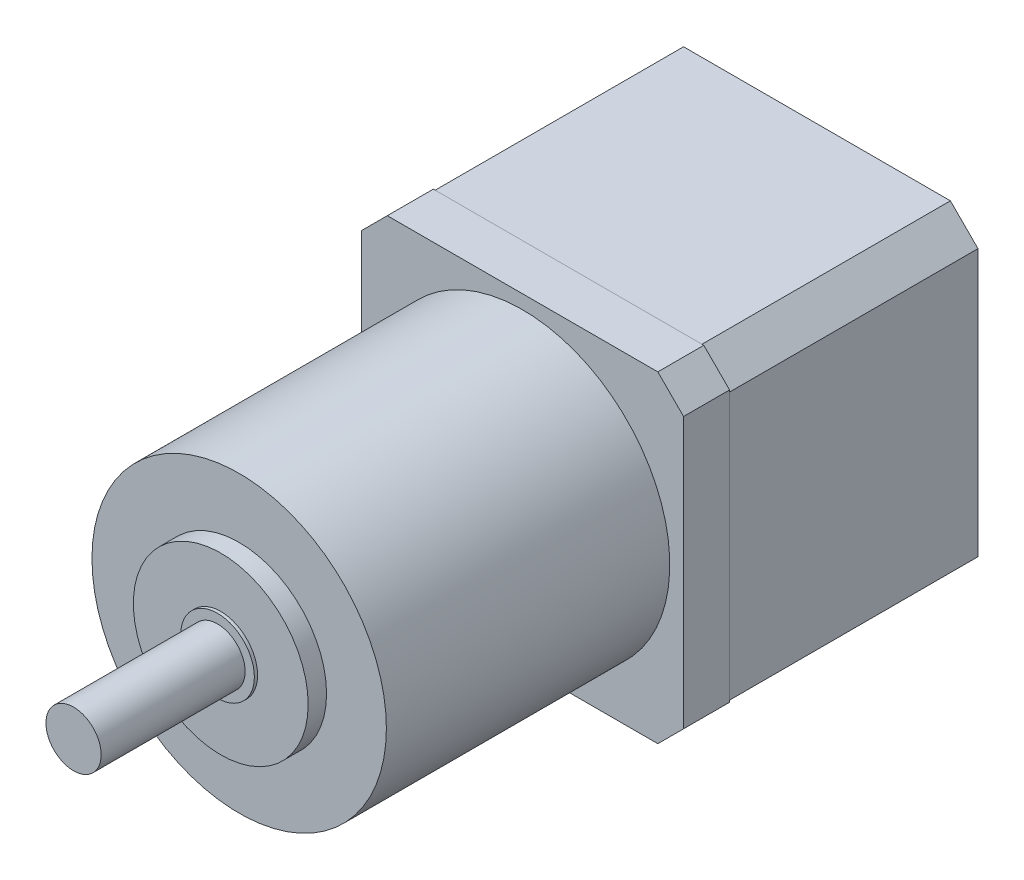
ISO-10303-21;
HEADER;
FILE_DESCRIPTION(('STEP AP214'),'2;1');
FILE_NAME('part.step','',(''),(''),'','','');
FILE_SCHEMA(('AUTOMOTIVE_DESIGN { 1 0 10303 214 1 1 1 1 }'));
ENDSEC;
DATA;
#1=APPLICATION_CONTEXT('core data for automotive mechanical design processes');
#2=APPLICATION_PROTOCOL_DEFINITION('international standard','automotive_design',2000,#1);
#3=PRODUCT_CONTEXT('',#1,'mechanical');
#4=PRODUCT('Part','Part','',(#3));
#5=PRODUCT_RELATED_PRODUCT_CATEGORY('part','',(#4));
#6=PRODUCT_DEFINITION_FORMATION('','',#4);
#7=PRODUCT_DEFINITION_CONTEXT('part definition',#1,'design');
#8=PRODUCT_DEFINITION('design','',#6,#7);
#9=PRODUCT_DEFINITION_SHAPE('','',#8);
#10=(LENGTH_UNIT() NAMED_UNIT(*) SI_UNIT(.MILLI.,.METRE.));
#11=(NAMED_UNIT(*) PLANE_ANGLE_UNIT() SI_UNIT($,.RADIAN.));
#12=(NAMED_UNIT(*) SI_UNIT($,.STERADIAN.) SOLID_ANGLE_UNIT());
#13=UNCERTAINTY_MEASURE_WITH_UNIT(LENGTH_MEASURE(1.E-05),#10,'distance_accuracy_value','');
#14=(GEOMETRIC_REPRESENTATION_CONTEXT(3) GLOBAL_UNCERTAINTY_ASSIGNED_CONTEXT((#13)) GLOBAL_UNIT_ASSIGNED_CONTEXT((#10,
#11,#12)) REPRESENTATION_CONTEXT('',''));
#15=CARTESIAN_POINT('',(0.,0.,0.));
#16=DIRECTION('',(0.,0.,1.));
#17=DIRECTION('',(1.,0.,0.));
#18=AXIS2_PLACEMENT_3D('',#15,#16,#17);
#19=CARTESIAN_POINT('',(17.5,-17.5,32.));
#20=DIRECTION('',(-1.,0.,0.));
#21=DIRECTION('',(0.,0.,1.));
#22=AXIS2_PLACEMENT_3D('',#19,#20,#21);
#23=PLANE('',#22);
#24=DIRECTION('',(0.,1.,0.));
#25=VECTOR('',#24,1.);
#26=CARTESIAN_POINT('',(17.5,-17.5,32.));
#27=LINE('',#26,#25);
#28=CARTESIAN_POINT('',(17.5,-14.7,32.));
#29=VERTEX_POINT('',#28);
#30=CARTESIAN_POINT('',(17.5,14.7,32.));
#31=VERTEX_POINT('',#30);
#32=EDGE_CURVE('E139',#29,#31,#27,.T.);
#33=ORIENTED_EDGE('',*,*,#32,.F.);
#34=DIRECTION('',(0.,0.,-1.));
#35=VECTOR('',#34,1.);
#36=CARTESIAN_POINT('',(17.5,-14.7,32.));
#37=LINE('',#36,#35);
#38=CARTESIAN_POINT('',(17.5,-14.7,27.));
#39=VERTEX_POINT('',#38);
#40=EDGE_CURVE('E165',#29,#39,#37,.T.);
#41=ORIENTED_EDGE('',*,*,#40,.T.);
#42=DIRECTION('',(0.,1.,0.));
#43=VECTOR('',#42,1.);
#44=CARTESIAN_POINT('',(17.5,-17.5,27.));
#45=LINE('',#44,#43);
#46=CARTESIAN_POINT('',(17.5,14.7,27.));
#47=VERTEX_POINT('',#46);
#48=EDGE_CURVE('E176',#39,#47,#45,.T.);
#49=ORIENTED_EDGE('',*,*,#48,.T.);
#50=DIRECTION('',(0.,0.,1.));
#51=VECTOR('',#50,1.);
#52=CARTESIAN_POINT('',(17.5,14.7,32.));
#53=LINE('',#52,#51);
#54=EDGE_CURVE('E163',#47,#31,#53,.T.);
#55=ORIENTED_EDGE('',*,*,#54,.T.);
#56=EDGE_LOOP('',(#33,#41,#49,#55));
#57=FACE_BOUND('',#56,.T.);
#58=ADVANCED_FACE('F46',(#57),#23,.F.);
#59=CARTESIAN_POINT('',(-17.5,17.5,32.));
#60=DIRECTION('',(0.,-1.,0.));
#61=DIRECTION('',(0.,0.,-1.));
#62=AXIS2_PLACEMENT_3D('',#59,#60,#61);
#63=PLANE('',#62);
#64=DIRECTION('',(-1.,0.,0.));
#65=VECTOR('',#64,1.);
#66=CARTESIAN_POINT('',(-17.5,17.5,27.));
#67=LINE('',#66,#65);
#68=CARTESIAN_POINT('',(14.7,17.5,27.));
#69=VERTEX_POINT('',#68);
#70=CARTESIAN_POINT('',(-14.7,17.5,27.));
#71=VERTEX_POINT('',#70);
#72=EDGE_CURVE('E144',#69,#71,#67,.T.);
#73=ORIENTED_EDGE('',*,*,#72,.T.);
#74=DIRECTION('',(0.,0.,1.));
#75=VECTOR('',#74,1.);
#76=CARTESIAN_POINT('',(-14.7,17.5,32.));
#77=LINE('',#76,#75);
#78=CARTESIAN_POINT('',(-14.7,17.5,32.));
#79=VERTEX_POINT('',#78);
#80=EDGE_CURVE('E55',#71,#79,#77,.T.);
#81=ORIENTED_EDGE('',*,*,#80,.T.);
#82=DIRECTION('',(-1.,0.,0.));
#83=VECTOR('',#82,1.);
#84=CARTESIAN_POINT('',(-17.5,17.5,32.));
#85=LINE('',#84,#83);
#86=CARTESIAN_POINT('',(14.7,17.5,32.));
#87=VERTEX_POINT('',#86);
#88=EDGE_CURVE('E142',#87,#79,#85,.T.);
#89=ORIENTED_EDGE('',*,*,#88,.F.);
#90=DIRECTION('',(0.,0.,-1.));
#91=VECTOR('',#90,1.);
#92=CARTESIAN_POINT('',(14.7,17.5,32.));
#93=LINE('',#92,#91);
#94=EDGE_CURVE('E168',#87,#69,#93,.T.);
#95=ORIENTED_EDGE('',*,*,#94,.T.);
#96=EDGE_LOOP('',(#73,#81,#89,#95));
#97=FACE_BOUND('',#96,.T.);
#98=ADVANCED_FACE('F173',(#97),#63,.F.);
#99=CARTESIAN_POINT('',(-17.5,-17.5,32.));
#100=DIRECTION('',(1.,0.,0.));
#101=DIRECTION('',(0.,0.,-1.));
#102=AXIS2_PLACEMENT_3D('',#99,#100,#101);
#103=PLANE('',#102);
#104=DIRECTION('',(0.,-1.,0.));
#105=VECTOR('',#104,1.);
#106=CARTESIAN_POINT('',(-17.5,-17.5,27.));
#107=LINE('',#106,#105);
#108=CARTESIAN_POINT('',(-17.5,14.7,27.));
#109=VERTEX_POINT('',#108);
#110=CARTESIAN_POINT('',(-17.5,-14.7,27.));
#111=VERTEX_POINT('',#110);
#112=EDGE_CURVE('E140',#109,#111,#107,.T.);
#113=ORIENTED_EDGE('',*,*,#112,.T.);
#114=DIRECTION('',(0.,0.,1.));
#115=VECTOR('',#114,1.);
#116=CARTESIAN_POINT('',(-17.5,-14.7,32.));
#117=LINE('',#116,#115);
#118=CARTESIAN_POINT('',(-17.5,-14.7,32.));
#119=VERTEX_POINT('',#118);
#120=EDGE_CURVE('E118',#111,#119,#117,.T.);
#121=ORIENTED_EDGE('',*,*,#120,.T.);
#122=DIRECTION('',(0.,-1.,0.));
#123=VECTOR('',#122,1.);
#124=CARTESIAN_POINT('',(-17.5,-17.5,32.));
#125=LINE('',#124,#123);
#126=CARTESIAN_POINT('',(-17.5,14.7,32.));
#127=VERTEX_POINT('',#126);
#128=EDGE_CURVE('E181',#127,#119,#125,.T.);
#129=ORIENTED_EDGE('',*,*,#128,.F.);
#130=DIRECTION('',(0.,0.,-1.));
#131=VECTOR('',#130,1.);
#132=CARTESIAN_POINT('',(-17.5,14.7,32.));
#133=LINE('',#132,#131);
#134=EDGE_CURVE('E123',#127,#109,#133,.T.);
#135=ORIENTED_EDGE('',*,*,#134,.T.);
#136=EDGE_LOOP('',(#113,#121,#129,#135));
#137=FACE_BOUND('',#136,.T.);
#138=ADVANCED_FACE('F229',(#137),#103,.F.);
#139=CARTESIAN_POINT('',(-17.5,-17.5,32.));
#140=DIRECTION('',(0.,1.,0.));
#141=DIRECTION('',(0.,0.,1.));
#142=AXIS2_PLACEMENT_3D('',#139,#140,#141);
#143=PLANE('',#142);
#144=DIRECTION('',(1.,0.,0.));
#145=VECTOR('',#144,1.);
#146=CARTESIAN_POINT('',(-17.5,-17.5,32.));
#147=LINE('',#146,#145);
#148=CARTESIAN_POINT('',(-14.7,-17.5,32.));
#149=VERTEX_POINT('',#148);
#150=CARTESIAN_POINT('',(14.7,-17.5,32.));
#151=VERTEX_POINT('',#150);
#152=EDGE_CURVE('E133',#149,#151,#147,.T.);
#153=ORIENTED_EDGE('',*,*,#152,.F.);
#154=DIRECTION('',(0.,0.,-1.));
#155=VECTOR('',#154,1.);
#156=CARTESIAN_POINT('',(-14.7,-17.5,32.));
#157=LINE('',#156,#155);
#158=CARTESIAN_POINT('',(-14.7,-17.5,27.));
#159=VERTEX_POINT('',#158);
#160=EDGE_CURVE('E117',#149,#159,#157,.T.);
#161=ORIENTED_EDGE('',*,*,#160,.T.);
#162=DIRECTION('',(1.,0.,0.));
#163=VECTOR('',#162,1.);
#164=CARTESIAN_POINT('',(-17.5,-17.5,27.));
#165=LINE('',#164,#163);
#166=CARTESIAN_POINT('',(14.7,-17.5,27.));
#167=VERTEX_POINT('',#166);
#168=EDGE_CURVE('E130',#159,#167,#165,.T.);
#169=ORIENTED_EDGE('',*,*,#168,.T.);
#170=DIRECTION('',(0.,0.,1.));
#171=VECTOR('',#170,1.);
#172=CARTESIAN_POINT('',(14.7,-17.5,32.));
#173=LINE('',#172,#171);
#174=EDGE_CURVE('E135',#167,#151,#173,.T.);
#175=ORIENTED_EDGE('',*,*,#174,.T.);
#176=EDGE_LOOP('',(#153,#161,#169,#175));
#177=FACE_BOUND('',#176,.T.);
#178=ADVANCED_FACE('F129',(#177),#143,.F.);
#179=CARTESIAN_POINT('',(0.,0.,32.));
#180=DIRECTION('',(0.,0.,-1.));
#181=DIRECTION('',(-1.,0.,0.));
#182=AXIS2_PLACEMENT_3D('',#179,#180,#181);
#183=PLANE('',#182);
#184=CARTESIAN_POINT('',(0.,0.,32.));
#185=DIRECTION('',(0.,0.,-1.));
#186=DIRECTION('',(-1.,0.,0.));
#187=AXIS2_PLACEMENT_3D('',#184,#185,#186);
#188=CIRCLE('',#187,16.);
#189=CARTESIAN_POINT('',(-16.,0.,32.));
#190=VERTEX_POINT('',#189);
#191=EDGE_CURVE('E12',#190,#190,#188,.F.);
#192=ORIENTED_EDGE('',*,*,#191,.F.);
#193=EDGE_LOOP('',(#192));
#194=FACE_BOUND('',#193,.T.);
#195=ORIENTED_EDGE('',*,*,#128,.T.);
#196=DIRECTION('',(-0.707106781186547,0.707106781186548,0.));
#197=VECTOR('',#196,1.);
#198=CARTESIAN_POINT('',(-14.7,-17.5,32.));
#199=LINE('',#198,#197);
#200=EDGE_CURVE('E161',#119,#149,#199,.F.);
#201=ORIENTED_EDGE('',*,*,#200,.T.);
#202=ORIENTED_EDGE('',*,*,#152,.T.);
#203=DIRECTION('',(-0.707106781186548,-0.707106781186547,0.));
#204=VECTOR('',#203,1.);
#205=CARTESIAN_POINT('',(17.5,-14.7,32.));
#206=LINE('',#205,#204);
#207=EDGE_CURVE('E159',#151,#29,#206,.F.);
#208=ORIENTED_EDGE('',*,*,#207,.T.);
#209=ORIENTED_EDGE('',*,*,#32,.T.);
#210=DIRECTION('',(0.707106781186547,-0.707106781186548,0.));
#211=VECTOR('',#210,1.);
#212=CARTESIAN_POINT('',(14.7,17.5,32.));
#213=LINE('',#212,#211);
#214=EDGE_CURVE('E68',#31,#87,#213,.F.);
#215=ORIENTED_EDGE('',*,*,#214,.T.);
#216=ORIENTED_EDGE('',*,*,#88,.T.);
#217=DIRECTION('',(0.707106781186548,0.707106781186547,0.));
#218=VECTOR('',#217,1.);
#219=CARTESIAN_POINT('',(-17.5,14.7,32.));
#220=LINE('',#219,#218);
#221=EDGE_CURVE('E157',#79,#127,#220,.F.);
#222=ORIENTED_EDGE('',*,*,#221,.T.);
#223=EDGE_LOOP('',(#195,#201,#202,#208,#209,#215,#216,#222));
#224=FACE_BOUND('',#223,.T.);
#225=ADVANCED_FACE('F249',(#194,#224),#183,.F.);
#226=CARTESIAN_POINT('',(0.,0.,27.));
#227=DIRECTION('',(0.,0.,-1.));
#228=DIRECTION('',(-1.,0.,0.));
#229=AXIS2_PLACEMENT_3D('',#226,#227,#228);
#230=PLANE('',#229);
#231=ORIENTED_EDGE('',*,*,#168,.F.);
#232=DIRECTION('',(0.707106781186547,-0.707106781186548,0.));
#233=VECTOR('',#232,1.);
#234=CARTESIAN_POINT('',(-16.1,-16.1,27.));
#235=LINE('',#234,#233);
#236=EDGE_CURVE('E113',#159,#111,#235,.F.);
#237=ORIENTED_EDGE('',*,*,#236,.T.);
#238=ORIENTED_EDGE('',*,*,#112,.F.);
#239=DIRECTION('',(-0.707106781186548,-0.707106781186547,0.));
#240=VECTOR('',#239,1.);
#241=CARTESIAN_POINT('',(-16.1,16.1,27.));
#242=LINE('',#241,#240);
#243=EDGE_CURVE('E150',#109,#71,#242,.F.);
#244=ORIENTED_EDGE('',*,*,#243,.T.);
#245=ORIENTED_EDGE('',*,*,#72,.F.);
#246=DIRECTION('',(-0.707106781186547,0.707106781186548,0.));
#247=VECTOR('',#246,1.);
#248=CARTESIAN_POINT('',(16.1,16.1,27.));
#249=LINE('',#248,#247);
#250=EDGE_CURVE('E134',#69,#47,#249,.F.);
#251=ORIENTED_EDGE('',*,*,#250,.T.);
#252=ORIENTED_EDGE('',*,*,#48,.F.);
#253=DIRECTION('',(0.707106781186548,0.707106781186547,0.));
#254=VECTOR('',#253,1.);
#255=CARTESIAN_POINT('',(16.1,-16.1,27.));
#256=LINE('',#255,#254);
#257=EDGE_CURVE('E124',#39,#167,#256,.F.);
#258=ORIENTED_EDGE('',*,*,#257,.T.);
#259=EDGE_LOOP('',(#231,#237,#238,#244,#245,#251,#252,#258));
#260=FACE_BOUND('',#259,.T.);
#261=ADVANCED_FACE('F137',(#260),#230,.T.);
#262=CARTESIAN_POINT('',(-14.7,-17.5,32.));
#263=DIRECTION('',(0.707106781186548,0.707106781186547,0.));
#264=DIRECTION('',(0.,0.,-1.));
#265=AXIS2_PLACEMENT_3D('',#262,#263,#264);
#266=PLANE('',#265);
#267=ORIENTED_EDGE('',*,*,#200,.F.);
#268=ORIENTED_EDGE('',*,*,#120,.F.);
#269=ORIENTED_EDGE('',*,*,#236,.F.);
#270=ORIENTED_EDGE('',*,*,#160,.F.);
#271=EDGE_LOOP('',(#267,#268,#269,#270));
#272=FACE_BOUND('',#271,.T.);
#273=ADVANCED_FACE('F116',(#272),#266,.F.);
#274=CARTESIAN_POINT('',(17.5,-14.7,32.));
#275=DIRECTION('',(-0.707106781186547,0.707106781186548,0.));
#276=DIRECTION('',(0.,0.,-1.));
#277=AXIS2_PLACEMENT_3D('',#274,#275,#276);
#278=PLANE('',#277);
#279=ORIENTED_EDGE('',*,*,#207,.F.);
#280=ORIENTED_EDGE('',*,*,#174,.F.);
#281=ORIENTED_EDGE('',*,*,#257,.F.);
#282=ORIENTED_EDGE('',*,*,#40,.F.);
#283=EDGE_LOOP('',(#279,#280,#281,#282));
#284=FACE_BOUND('',#283,.T.);
#285=ADVANCED_FACE('F236',(#284),#278,.F.);
#286=CARTESIAN_POINT('',(-17.5,14.7,32.));
#287=DIRECTION('',(0.707106781186547,-0.707106781186548,0.));
#288=DIRECTION('',(0.,0.,-1.));
#289=AXIS2_PLACEMENT_3D('',#286,#287,#288);
#290=PLANE('',#289);
#291=ORIENTED_EDGE('',*,*,#221,.F.);
#292=ORIENTED_EDGE('',*,*,#80,.F.);
#293=ORIENTED_EDGE('',*,*,#243,.F.);
#294=ORIENTED_EDGE('',*,*,#134,.F.);
#295=EDGE_LOOP('',(#291,#292,#293,#294));
#296=FACE_BOUND('',#295,.T.);
#297=ADVANCED_FACE('F238',(#296),#290,.F.);
#298=CARTESIAN_POINT('',(14.7,17.5,32.));
#299=DIRECTION('',(-0.707106781186548,-0.707106781186547,0.));
#300=DIRECTION('',(0.,0.,-1.));
#301=AXIS2_PLACEMENT_3D('',#298,#299,#300);
#302=PLANE('',#301);
#303=ORIENTED_EDGE('',*,*,#214,.F.);
#304=ORIENTED_EDGE('',*,*,#54,.F.);
#305=ORIENTED_EDGE('',*,*,#250,.F.);
#306=ORIENTED_EDGE('',*,*,#94,.F.);
#307=EDGE_LOOP('',(#303,#304,#305,#306));
#308=FACE_BOUND('',#307,.T.);
#309=ADVANCED_FACE('F48',(#308),#302,.F.);
#310=CARTESIAN_POINT('',(0.,0.,62.8));
#311=DIRECTION('',(0.,0.,-1.));
#312=DIRECTION('',(-1.,0.,0.));
#313=AXIS2_PLACEMENT_3D('',#310,#311,#312);
#314=CYLINDRICAL_SURFACE('',#313,16.);
#315=CARTESIAN_POINT('',(0.,0.,62.8));
#316=DIRECTION('',(0.,0.,1.));
#317=DIRECTION('',(1.,0.,0.));
#318=AXIS2_PLACEMENT_3D('',#315,#316,#317);
#319=CIRCLE('',#318,16.);
#320=CARTESIAN_POINT('',(16.,0.,62.8));
#321=VERTEX_POINT('',#320);
#322=EDGE_CURVE('E177',#321,#321,#319,.T.);
#323=ORIENTED_EDGE('',*,*,#322,.F.);
#324=EDGE_LOOP('',(#323));
#325=FACE_BOUND('',#324,.T.);
#326=ORIENTED_EDGE('',*,*,#191,.T.);
#327=EDGE_LOOP('',(#326));
#328=FACE_BOUND('',#327,.T.);
#329=ADVANCED_FACE('F245',(#325,#328),#314,.T.);
#330=CARTESIAN_POINT('',(0.,0.,62.8));
#331=DIRECTION('',(0.,0.,1.));
#332=DIRECTION('',(1.,0.,0.));
#333=AXIS2_PLACEMENT_3D('',#330,#331,#332);
#334=PLANE('',#333);
#335=CARTESIAN_POINT('',(0.,0.,62.8));
#336=DIRECTION('',(0.,0.,1.));
#337=DIRECTION('',(1.,0.,0.));
#338=AXIS2_PLACEMENT_3D('',#335,#336,#337);
#339=CIRCLE('',#338,9.5);
#340=CARTESIAN_POINT('',(9.5,0.,62.8));
#341=VERTEX_POINT('',#340);
#342=EDGE_CURVE('E188',#341,#341,#339,.T.);
#343=ORIENTED_EDGE('',*,*,#342,.F.);
#344=EDGE_LOOP('',(#343));
#345=FACE_BOUND('',#344,.T.);
#346=ORIENTED_EDGE('',*,*,#322,.T.);
#347=EDGE_LOOP('',(#346));
#348=FACE_BOUND('',#347,.T.);
#349=ADVANCED_FACE('F264',(#345,#348),#334,.T.);
#350=CARTESIAN_POINT('',(0.,0.,64.8));
#351=DIRECTION('',(0.,0.,-1.));
#352=DIRECTION('',(-1.,0.,0.));
#353=AXIS2_PLACEMENT_3D('',#350,#351,#352);
#354=CYLINDRICAL_SURFACE('',#353,9.5);
#355=CARTESIAN_POINT('',(0.,0.,64.8));
#356=DIRECTION('',(0.,0.,1.));
#357=DIRECTION('',(1.,0.,0.));
#358=AXIS2_PLACEMENT_3D('',#355,#356,#357);
#359=CIRCLE('',#358,9.5);
#360=CARTESIAN_POINT('',(9.5,0.,64.8));
#361=VERTEX_POINT('',#360);
#362=EDGE_CURVE('E187',#361,#361,#359,.T.);
#363=ORIENTED_EDGE('',*,*,#362,.F.);
#364=EDGE_LOOP('',(#363));
#365=FACE_BOUND('',#364,.T.);
#366=ORIENTED_EDGE('',*,*,#342,.T.);
#367=EDGE_LOOP('',(#366));
#368=FACE_BOUND('',#367,.T.);
#369=ADVANCED_FACE('F268',(#365,#368),#354,.T.);
#370=CARTESIAN_POINT('',(0.,0.,64.8));
#371=DIRECTION('',(0.,0.,1.));
#372=DIRECTION('',(1.,0.,0.));
#373=AXIS2_PLACEMENT_3D('',#370,#371,#372);
#374=PLANE('',#373);
#375=CARTESIAN_POINT('',(0.,0.,64.8));
#376=DIRECTION('',(0.,0.,1.));
#377=DIRECTION('',(1.,0.,0.));
#378=AXIS2_PLACEMENT_3D('',#375,#376,#377);
#379=CIRCLE('',#378,4.);
#380=CARTESIAN_POINT('',(4.,0.,64.8));
#381=VERTEX_POINT('',#380);
#382=EDGE_CURVE('E196',#381,#381,#379,.T.);
#383=ORIENTED_EDGE('',*,*,#382,.F.);
#384=EDGE_LOOP('',(#383));
#385=FACE_BOUND('',#384,.T.);
#386=ORIENTED_EDGE('',*,*,#362,.T.);
#387=EDGE_LOOP('',(#386));
#388=FACE_BOUND('',#387,.T.);
#389=ADVANCED_FACE('F220',(#385,#388),#374,.T.);
#390=CARTESIAN_POINT('',(0.,0.,65.15));
#391=DIRECTION('',(0.,0.,-1.));
#392=DIRECTION('',(-1.,0.,0.));
#393=AXIS2_PLACEMENT_3D('',#390,#391,#392);
#394=CYLINDRICAL_SURFACE('',#393,4.);
#395=CARTESIAN_POINT('',(0.,0.,65.15));
#396=DIRECTION('',(0.,0.,1.));
#397=DIRECTION('',(1.,0.,0.));
#398=AXIS2_PLACEMENT_3D('',#395,#396,#397);
#399=CIRCLE('',#398,4.);
#400=CARTESIAN_POINT('',(4.,0.,65.15));
#401=VERTEX_POINT('',#400);
#402=EDGE_CURVE('E199',#401,#401,#399,.T.);
#403=ORIENTED_EDGE('',*,*,#402,.F.);
#404=EDGE_LOOP('',(#403));
#405=FACE_BOUND('',#404,.T.);
#406=ORIENTED_EDGE('',*,*,#382,.T.);
#407=EDGE_LOOP('',(#406));
#408=FACE_BOUND('',#407,.T.);
#409=ADVANCED_FACE('F212',(#405,#408),#394,.T.);
#410=CARTESIAN_POINT('',(0.,0.,65.15));
#411=DIRECTION('',(0.,0.,1.));
#412=DIRECTION('',(1.,0.,0.));
#413=AXIS2_PLACEMENT_3D('',#410,#411,#412);
#414=PLANE('',#413);
#415=CARTESIAN_POINT('',(0.,0.,65.15));
#416=DIRECTION('',(0.,0.,1.));
#417=DIRECTION('',(1.,0.,0.));
#418=AXIS2_PLACEMENT_3D('',#415,#416,#417);
#419=CIRCLE('',#418,3.);
#420=CARTESIAN_POINT('',(3.,0.,65.15));
#421=VERTEX_POINT('',#420);
#422=EDGE_CURVE('E50',#421,#421,#419,.T.);
#423=ORIENTED_EDGE('',*,*,#422,.F.);
#424=EDGE_LOOP('',(#423));
#425=FACE_BOUND('',#424,.T.);
#426=ORIENTED_EDGE('',*,*,#402,.T.);
#427=EDGE_LOOP('',(#426));
#428=FACE_BOUND('',#427,.T.);
#429=ADVANCED_FACE('F209',(#425,#428),#414,.T.);
#430=CARTESIAN_POINT('',(0.,0.,80.8));
#431=DIRECTION('',(0.,0.,1.));
#432=DIRECTION('',(1.,0.,0.));
#433=AXIS2_PLACEMENT_3D('',#430,#431,#432);
#434=PLANE('',#433);
#435=CARTESIAN_POINT('',(0.,0.,80.8));
#436=DIRECTION('',(0.,0.,1.));
#437=DIRECTION('',(1.,0.,0.));
#438=AXIS2_PLACEMENT_3D('',#435,#436,#437);
#439=CIRCLE('',#438,3.);
#440=CARTESIAN_POINT('',(3.,0.,80.8));
#441=VERTEX_POINT('',#440);
#442=EDGE_CURVE('E191',#441,#441,#439,.T.);
#443=ORIENTED_EDGE('',*,*,#442,.T.);
#444=EDGE_LOOP('',(#443));
#445=FACE_BOUND('',#444,.T.);
#446=ADVANCED_FACE('F211',(#445),#434,.T.);
#447=CARTESIAN_POINT('',(0.,0.,80.8));
#448=DIRECTION('',(0.,0.,-1.));
#449=DIRECTION('',(-1.,0.,0.));
#450=AXIS2_PLACEMENT_3D('',#447,#448,#449);
#451=CYLINDRICAL_SURFACE('',#450,3.);
#452=ORIENTED_EDGE('',*,*,#422,.T.);
#453=EDGE_LOOP('',(#452));
#454=FACE_BOUND('',#453,.T.);
#455=ORIENTED_EDGE('',*,*,#442,.F.);
#456=EDGE_LOOP('',(#455));
#457=FACE_BOUND('',#456,.T.);
#458=ADVANCED_FACE('F206',(#454,#457),#451,.T.);
#459=CLOSED_SHELL('',(#58,#98,#138,#178,#225,#261,#273,#285,#297,#309,#329,#349,#369,#389,#409,
#429,#446,#458));
#460=MANIFOLD_SOLID_BREP('B2',#459);
#461=CARTESIAN_POINT('',(17.5,17.5,27.));
#462=DIRECTION('',(-1.,0.,0.));
#463=DIRECTION('',(0.,-1.,0.));
#464=AXIS2_PLACEMENT_3D('',#461,#462,#463);
#465=PLANE('',#464);
#466=DIRECTION('',(0.,1.,0.));
#467=VECTOR('',#466,1.);
#468=CARTESIAN_POINT('',(17.5,17.5,27.));
#469=LINE('',#468,#467);
#470=CARTESIAN_POINT('',(17.5,-14.5,27.));
#471=VERTEX_POINT('',#470);
#472=CARTESIAN_POINT('',(17.5,14.5,27.));
#473=VERTEX_POINT('',#472);
#474=EDGE_CURVE('E492',#471,#473,#469,.T.);
#475=ORIENTED_EDGE('',*,*,#474,.F.);
#476=DIRECTION('',(0.,0.,-1.));
#477=VECTOR('',#476,1.);
#478=CARTESIAN_POINT('',(17.5,-14.5,27.));
#479=LINE('',#478,#477);
#480=CARTESIAN_POINT('',(17.5,-14.5,0.));
#481=VERTEX_POINT('',#480);
#482=EDGE_CURVE('E518',#471,#481,#479,.T.);
#483=ORIENTED_EDGE('',*,*,#482,.T.);
#484=DIRECTION('',(0.,1.,0.));
#485=VECTOR('',#484,1.);
#486=CARTESIAN_POINT('',(17.5,17.5,0.));
#487=LINE('',#486,#485);
#488=CARTESIAN_POINT('',(17.5,14.5,0.));
#489=VERTEX_POINT('',#488);
#490=EDGE_CURVE('E526',#481,#489,#487,.T.);
#491=ORIENTED_EDGE('',*,*,#490,.T.);
#492=DIRECTION('',(0.,0.,1.));
#493=VECTOR('',#492,1.);
#494=CARTESIAN_POINT('',(17.5,14.5,27.));
#495=LINE('',#494,#493);
#496=EDGE_CURVE('E516',#489,#473,#495,.T.);
#497=ORIENTED_EDGE('',*,*,#496,.T.);
#498=EDGE_LOOP('',(#475,#483,#491,#497));
#499=FACE_BOUND('',#498,.T.);
#500=ADVANCED_FACE('F401',(#499),#465,.F.);
#501=CARTESIAN_POINT('',(-17.5,17.5,27.));
#502=DIRECTION('',(0.,-1.,0.));
#503=DIRECTION('',(0.,0.,-1.));
#504=AXIS2_PLACEMENT_3D('',#501,#502,#503);
#505=PLANE('',#504);
#506=DIRECTION('',(-1.,0.,0.));
#507=VECTOR('',#506,1.);
#508=CARTESIAN_POINT('',(-17.5,17.5,0.));
#509=LINE('',#508,#507);
#510=CARTESIAN_POINT('',(14.5,17.5,0.));
#511=VERTEX_POINT('',#510);
#512=CARTESIAN_POINT('',(-14.5,17.5,0.));
#513=VERTEX_POINT('',#512);
#514=EDGE_CURVE('E497',#511,#513,#509,.T.);
#515=ORIENTED_EDGE('',*,*,#514,.T.);
#516=DIRECTION('',(0.,0.,1.));
#517=VECTOR('',#516,1.);
#518=CARTESIAN_POINT('',(-14.5,17.5,27.));
#519=LINE('',#518,#517);
#520=CARTESIAN_POINT('',(-14.5,17.5,27.));
#521=VERTEX_POINT('',#520);
#522=EDGE_CURVE('E44',#513,#521,#519,.T.);
#523=ORIENTED_EDGE('',*,*,#522,.T.);
#524=DIRECTION('',(-1.,0.,0.));
#525=VECTOR('',#524,1.);
#526=CARTESIAN_POINT('',(-17.5,17.5,27.));
#527=LINE('',#526,#525);
#528=CARTESIAN_POINT('',(14.5,17.5,27.));
#529=VERTEX_POINT('',#528);
#530=EDGE_CURVE('E495',#529,#521,#527,.T.);
#531=ORIENTED_EDGE('',*,*,#530,.F.);
#532=DIRECTION('',(0.,0.,-1.));
#533=VECTOR('',#532,1.);
#534=CARTESIAN_POINT('',(14.5,17.5,27.));
#535=LINE('',#534,#533);
#536=EDGE_CURVE('E409',#529,#511,#535,.T.);
#537=ORIENTED_EDGE('',*,*,#536,.T.);
#538=EDGE_LOOP('',(#515,#523,#531,#537));
#539=FACE_BOUND('',#538,.T.);
#540=ADVANCED_FACE('F523',(#539),#505,.F.);
#541=CARTESIAN_POINT('',(-17.5,17.5,27.));
#542=DIRECTION('',(1.,0.,0.));
#543=DIRECTION('',(0.,1.,0.));
#544=AXIS2_PLACEMENT_3D('',#541,#542,#543);
#545=PLANE('',#544);
#546=DIRECTION('',(0.,-1.,0.));
#547=VECTOR('',#546,1.);
#548=CARTESIAN_POINT('',(-17.5,17.5,0.));
#549=LINE('',#548,#547);
#550=CARTESIAN_POINT('',(-17.5,14.5,0.));
#551=VERTEX_POINT('',#550);
#552=CARTESIAN_POINT('',(-17.5,-14.5,0.));
#553=VERTEX_POINT('',#552);
#554=EDGE_CURVE('E493',#551,#553,#549,.T.);
#555=ORIENTED_EDGE('',*,*,#554,.T.);
#556=DIRECTION('',(0.,0.,1.));
#557=VECTOR('',#556,1.);
#558=CARTESIAN_POINT('',(-17.5,-14.5,27.));
#559=LINE('',#558,#557);
#560=CARTESIAN_POINT('',(-17.5,-14.5,27.));
#561=VERTEX_POINT('',#560);
#562=EDGE_CURVE('E471',#553,#561,#559,.T.);
#563=ORIENTED_EDGE('',*,*,#562,.T.);
#564=DIRECTION('',(0.,-1.,0.));
#565=VECTOR('',#564,1.);
#566=CARTESIAN_POINT('',(-17.5,17.5,27.));
#567=LINE('',#566,#565);
#568=CARTESIAN_POINT('',(-17.5,14.5,27.));
#569=VERTEX_POINT('',#568);
#570=EDGE_CURVE('E530',#569,#561,#567,.T.);
#571=ORIENTED_EDGE('',*,*,#570,.F.);
#572=DIRECTION('',(0.,0.,-1.));
#573=VECTOR('',#572,1.);
#574=CARTESIAN_POINT('',(-17.5,14.5,27.));
#575=LINE('',#574,#573);
#576=EDGE_CURVE('E476',#569,#551,#575,.T.);
#577=ORIENTED_EDGE('',*,*,#576,.T.);
#578=EDGE_LOOP('',(#555,#563,#571,#577));
#579=FACE_BOUND('',#578,.T.);
#580=ADVANCED_FACE('F540',(#579),#545,.F.);
#581=CARTESIAN_POINT('',(-17.5,-17.5,27.));
#582=DIRECTION('',(0.,1.,0.));
#583=DIRECTION('',(0.,0.,1.));
#584=AXIS2_PLACEMENT_3D('',#581,#582,#583);
#585=PLANE('',#584);
#586=DIRECTION('',(1.,0.,0.));
#587=VECTOR('',#586,1.);
#588=CARTESIAN_POINT('',(-17.5,-17.5,27.));
#589=LINE('',#588,#587);
#590=CARTESIAN_POINT('',(-14.5,-17.5,27.));
#591=VERTEX_POINT('',#590);
#592=CARTESIAN_POINT('',(14.5,-17.5,27.));
#593=VERTEX_POINT('',#592);
#594=EDGE_CURVE('E486',#591,#593,#589,.T.);
#595=ORIENTED_EDGE('',*,*,#594,.F.);
#596=DIRECTION('',(0.,0.,-1.));
#597=VECTOR('',#596,1.);
#598=CARTESIAN_POINT('',(-14.5,-17.5,27.));
#599=LINE('',#598,#597);
#600=CARTESIAN_POINT('',(-14.5,-17.5,0.));
#601=VERTEX_POINT('',#600);
#602=EDGE_CURVE('E470',#591,#601,#599,.T.);
#603=ORIENTED_EDGE('',*,*,#602,.T.);
#604=DIRECTION('',(1.,0.,0.));
#605=VECTOR('',#604,1.);
#606=CARTESIAN_POINT('',(-17.5,-17.5,0.));
#607=LINE('',#606,#605);
#608=CARTESIAN_POINT('',(14.5,-17.5,0.));
#609=VERTEX_POINT('',#608);
#610=EDGE_CURVE('E483',#601,#609,#607,.T.);
#611=ORIENTED_EDGE('',*,*,#610,.T.);
#612=DIRECTION('',(0.,0.,1.));
#613=VECTOR('',#612,1.);
#614=CARTESIAN_POINT('',(14.5,-17.5,27.));
#615=LINE('',#614,#613);
#616=EDGE_CURVE('E488',#609,#593,#615,.T.);
#617=ORIENTED_EDGE('',*,*,#616,.T.);
#618=EDGE_LOOP('',(#595,#603,#611,#617));
#619=FACE_BOUND('',#618,.T.);
#620=ADVANCED_FACE('F482',(#619),#585,.F.);
#621=CARTESIAN_POINT('',(0.,0.,27.));
#622=DIRECTION('',(0.,0.,1.));
#623=DIRECTION('',(1.,0.,0.));
#624=AXIS2_PLACEMENT_3D('',#621,#622,#623);
#625=PLANE('',#624);
#626=ORIENTED_EDGE('',*,*,#570,.T.);
#627=DIRECTION('',(-0.707106781186547,0.707106781186548,0.));
#628=VECTOR('',#627,1.);
#629=CARTESIAN_POINT('',(-16.,-16.,27.));
#630=LINE('',#629,#628);
#631=EDGE_CURVE('E514',#561,#591,#630,.F.);
#632=ORIENTED_EDGE('',*,*,#631,.T.);
#633=ORIENTED_EDGE('',*,*,#594,.T.);
#634=DIRECTION('',(-0.70710678118655,-0.707106781186546,0.));
#635=VECTOR('',#634,1.);
#636=CARTESIAN_POINT('',(16.,-16.,27.));
#637=LINE('',#636,#635);
#638=EDGE_CURVE('E512',#593,#471,#637,.F.);
#639=ORIENTED_EDGE('',*,*,#638,.T.);
#640=ORIENTED_EDGE('',*,*,#474,.T.);
#641=DIRECTION('',(0.707106781186547,-0.707106781186548,0.));
#642=VECTOR('',#641,1.);
#643=CARTESIAN_POINT('',(16.,16.,27.));
#644=LINE('',#643,#642);
#645=EDGE_CURVE('E421',#473,#529,#644,.F.);
#646=ORIENTED_EDGE('',*,*,#645,.T.);
#647=ORIENTED_EDGE('',*,*,#530,.T.);
#648=DIRECTION('',(0.707106781186548,0.707106781186547,0.));
#649=VECTOR('',#648,1.);
#650=CARTESIAN_POINT('',(-16.,16.,27.));
#651=LINE('',#650,#649);
#652=EDGE_CURVE('E510',#521,#569,#651,.F.);
#653=ORIENTED_EDGE('',*,*,#652,.T.);
#654=EDGE_LOOP('',(#626,#632,#633,#639,#640,#646,#647,#653));
#655=FACE_BOUND('',#654,.T.);
#656=ADVANCED_FACE('F534',(#655),#625,.T.);
#657=CARTESIAN_POINT('',(0.,0.,0.));
#658=DIRECTION('',(0.,0.,1.));
#659=DIRECTION('',(1.,0.,0.));
#660=AXIS2_PLACEMENT_3D('',#657,#658,#659);
#661=PLANE('',#660);
#662=ORIENTED_EDGE('',*,*,#610,.F.);
#663=DIRECTION('',(0.707106781186547,-0.707106781186548,0.));
#664=VECTOR('',#663,1.);
#665=CARTESIAN_POINT('',(-14.5,-17.5,0.));
#666=LINE('',#665,#664);
#667=EDGE_CURVE('E466',#601,#553,#666,.F.);
#668=ORIENTED_EDGE('',*,*,#667,.T.);
#669=ORIENTED_EDGE('',*,*,#554,.F.);
#670=DIRECTION('',(-0.707106781186548,-0.707106781186547,0.));
#671=VECTOR('',#670,1.);
#672=CARTESIAN_POINT('',(-17.5,14.5,0.));
#673=LINE('',#672,#671);
#674=EDGE_CURVE('E503',#551,#513,#673,.F.);
#675=ORIENTED_EDGE('',*,*,#674,.T.);
#676=ORIENTED_EDGE('',*,*,#514,.F.);
#677=DIRECTION('',(-0.707106781186547,0.707106781186548,0.));
#678=VECTOR('',#677,1.);
#679=CARTESIAN_POINT('',(14.5,17.5,0.));
#680=LINE('',#679,#678);
#681=EDGE_CURVE('E487',#511,#489,#680,.F.);
#682=ORIENTED_EDGE('',*,*,#681,.T.);
#683=ORIENTED_EDGE('',*,*,#490,.F.);
#684=DIRECTION('',(0.70710678118655,0.707106781186546,0.));
#685=VECTOR('',#684,1.);
#686=CARTESIAN_POINT('',(17.5,-14.5,0.));
#687=LINE('',#686,#685);
#688=EDGE_CURVE('E477',#481,#609,#687,.F.);
#689=ORIENTED_EDGE('',*,*,#688,.T.);
#690=EDGE_LOOP('',(#662,#668,#669,#675,#676,#682,#683,#689));
#691=FACE_BOUND('',#690,.T.);
#692=ADVANCED_FACE('F490',(#691),#661,.F.);
#693=CARTESIAN_POINT('',(-14.5,-17.5,27.));
#694=DIRECTION('',(0.707106781186548,0.707106781186547,0.));
#695=DIRECTION('',(0.,0.,-1.));
#696=AXIS2_PLACEMENT_3D('',#693,#694,#695);
#697=PLANE('',#696);
#698=ORIENTED_EDGE('',*,*,#631,.F.);
#699=ORIENTED_EDGE('',*,*,#562,.F.);
#700=ORIENTED_EDGE('',*,*,#667,.F.);
#701=ORIENTED_EDGE('',*,*,#602,.F.);
#702=EDGE_LOOP('',(#698,#699,#700,#701));
#703=FACE_BOUND('',#702,.T.);
#704=ADVANCED_FACE('F469',(#703),#697,.F.);
#705=CARTESIAN_POINT('',(17.5,-14.5,27.));
#706=DIRECTION('',(-0.707106781186546,0.70710678118655,0.));
#707=DIRECTION('',(0.,0.,-1.));
#708=AXIS2_PLACEMENT_3D('',#705,#706,#707);
#709=PLANE('',#708);
#710=ORIENTED_EDGE('',*,*,#638,.F.);
#711=ORIENTED_EDGE('',*,*,#616,.F.);
#712=ORIENTED_EDGE('',*,*,#688,.F.);
#713=ORIENTED_EDGE('',*,*,#482,.F.);
#714=EDGE_LOOP('',(#710,#711,#712,#713));
#715=FACE_BOUND('',#714,.T.);
#716=ADVANCED_FACE('F545',(#715),#709,.F.);
#717=CARTESIAN_POINT('',(-17.5,14.5,27.));
#718=DIRECTION('',(0.707106781186547,-0.707106781186548,0.));
#719=DIRECTION('',(0.,0.,-1.));
#720=AXIS2_PLACEMENT_3D('',#717,#718,#719);
#721=PLANE('',#720);
#722=ORIENTED_EDGE('',*,*,#652,.F.);
#723=ORIENTED_EDGE('',*,*,#522,.F.);
#724=ORIENTED_EDGE('',*,*,#674,.F.);
#725=ORIENTED_EDGE('',*,*,#576,.F.);
#726=EDGE_LOOP('',(#722,#723,#724,#725));
#727=FACE_BOUND('',#726,.T.);
#728=ADVANCED_FACE('F538',(#727),#721,.F.);
#729=CARTESIAN_POINT('',(14.5,17.5,27.));
#730=DIRECTION('',(-0.707106781186548,-0.707106781186547,0.));
#731=DIRECTION('',(0.,0.,-1.));
#732=AXIS2_PLACEMENT_3D('',#729,#730,#731);
#733=PLANE('',#732);
#734=ORIENTED_EDGE('',*,*,#645,.F.);
#735=ORIENTED_EDGE('',*,*,#496,.F.);
#736=ORIENTED_EDGE('',*,*,#681,.F.);
#737=ORIENTED_EDGE('',*,*,#536,.F.);
#738=EDGE_LOOP('',(#734,#735,#736,#737));
#739=FACE_BOUND('',#738,.T.);
#740=ADVANCED_FACE('F403',(#739),#733,.F.);
#741=CLOSED_SHELL('',(#500,#540,#580,#620,#656,#692,#704,#716,#728,#740));
#742=MANIFOLD_SOLID_BREP('B6',#741);
#743=ADVANCED_BREP_SHAPE_REPRESENTATION('',(#18,#460,#742),#14);
#744=SHAPE_DEFINITION_REPRESENTATION(#9,#743);
ENDSEC;
END-ISO-10303-21;
